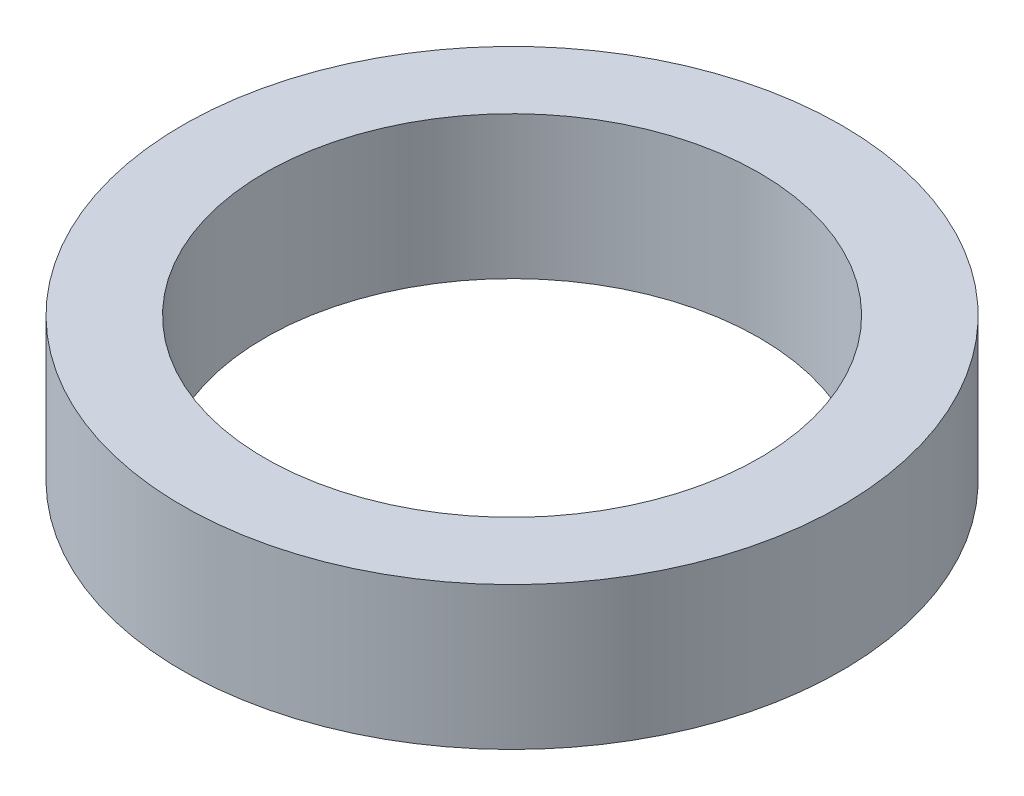
ISO-10303-21;
HEADER;
FILE_DESCRIPTION(('STEP AP214'),'2;1');
FILE_NAME('part.step','',(''),(''),'','','');
FILE_SCHEMA(('AUTOMOTIVE_DESIGN { 1 0 10303 214 1 1 1 1 }'));
ENDSEC;
DATA;
#1=APPLICATION_CONTEXT('core data for automotive mechanical design processes');
#2=APPLICATION_PROTOCOL_DEFINITION('international standard','automotive_design',2000,#1);
#3=PRODUCT_CONTEXT('',#1,'mechanical');
#4=PRODUCT('Part','Part','',(#3));
#5=PRODUCT_RELATED_PRODUCT_CATEGORY('part','',(#4));
#6=PRODUCT_DEFINITION_FORMATION('','',#4);
#7=PRODUCT_DEFINITION_CONTEXT('part definition',#1,'design');
#8=PRODUCT_DEFINITION('design','',#6,#7);
#9=PRODUCT_DEFINITION_SHAPE('','',#8);
#10=(LENGTH_UNIT() NAMED_UNIT(*) SI_UNIT(.MILLI.,.METRE.));
#11=(NAMED_UNIT(*) PLANE_ANGLE_UNIT() SI_UNIT($,.RADIAN.));
#12=(NAMED_UNIT(*) SI_UNIT($,.STERADIAN.) SOLID_ANGLE_UNIT());
#13=UNCERTAINTY_MEASURE_WITH_UNIT(LENGTH_MEASURE(1.E-05),#10,'distance_accuracy_value','');
#14=(GEOMETRIC_REPRESENTATION_CONTEXT(3) GLOBAL_UNCERTAINTY_ASSIGNED_CONTEXT((#13)) GLOBAL_UNIT_ASSIGNED_CONTEXT((#10,
#11,#12)) REPRESENTATION_CONTEXT('',''));
#15=CARTESIAN_POINT('',(0.,0.,0.));
#16=DIRECTION('',(0.,0.,1.));
#17=DIRECTION('',(1.,0.,0.));
#18=AXIS2_PLACEMENT_3D('',#15,#16,#17);
#19=CARTESIAN_POINT('',(0.,13.,0.));
#20=DIRECTION('',(0.,-1.,0.));
#21=DIRECTION('',(0.,0.,-1.));
#22=AXIS2_PLACEMENT_3D('',#19,#20,#21);
#23=CYLINDRICAL_SURFACE('',#22,30.);
#24=CARTESIAN_POINT('',(0.,13.,0.));
#25=DIRECTION('',(0.,1.,0.));
#26=DIRECTION('',(0.,0.,1.));
#27=AXIS2_PLACEMENT_3D('',#24,#25,#26);
#28=CIRCLE('',#27,30.);
#29=CARTESIAN_POINT('',(0.,13.,-30.));
#30=VERTEX_POINT('',#29);
#31=EDGE_CURVE('E10',#30,#30,#28,.T.);
#32=CARTESIAN_POINT('',(0.,0.,0.));
#33=DIRECTION('',(0.,1.,0.));
#34=DIRECTION('',(0.,0.,1.));
#35=AXIS2_PLACEMENT_3D('',#32,#33,#34);
#36=CIRCLE('',#35,30.);
#37=CARTESIAN_POINT('',(0.,0.,-30.));
#38=VERTEX_POINT('',#37);
#39=EDGE_CURVE('E37',#38,#38,#36,.T.);
#40=CARTESIAN_POINT('',(0.,13.,-30.));
#41=CARTESIAN_POINT('',(0.,12.8645833333333,-30.));
#42=CARTESIAN_POINT('',(0.,12.7291666666667,-30.));
#43=CARTESIAN_POINT('',(0.,12.4583333333333,-30.));
#44=CARTESIAN_POINT('',(0.,12.3229166666667,-30.));
#45=CARTESIAN_POINT('',(0.,12.0520833333333,-30.));
#46=CARTESIAN_POINT('',(0.,11.9166666666667,-30.));
#47=CARTESIAN_POINT('',(0.,11.6458333333333,-30.));
#48=CARTESIAN_POINT('',(0.,11.5104166666667,-30.));
#49=CARTESIAN_POINT('',(0.,11.2395833333333,-30.));
#50=CARTESIAN_POINT('',(0.,11.1041666666667,-30.));
#51=CARTESIAN_POINT('',(0.,10.8333333333333,-30.));
#52=CARTESIAN_POINT('',(0.,10.6979166666667,-30.));
#53=CARTESIAN_POINT('',(0.,10.4270833333333,-30.));
#54=CARTESIAN_POINT('',(0.,10.2916666666667,-30.));
#55=CARTESIAN_POINT('',(0.,10.0208333333333,-30.));
#56=CARTESIAN_POINT('',(0.,9.88541666666667,-30.));
#57=CARTESIAN_POINT('',(0.,9.61458333333333,-30.));
#58=CARTESIAN_POINT('',(0.,9.47916666666667,-30.));
#59=CARTESIAN_POINT('',(0.,9.20833333333333,-30.));
#60=CARTESIAN_POINT('',(0.,9.07291666666667,-30.));
#61=CARTESIAN_POINT('',(0.,8.80208333333333,-30.));
#62=CARTESIAN_POINT('',(0.,8.66666666666667,-30.));
#63=CARTESIAN_POINT('',(0.,8.39583333333333,-30.));
#64=CARTESIAN_POINT('',(0.,8.26041666666667,-30.));
#65=CARTESIAN_POINT('',(0.,7.98958333333333,-30.));
#66=CARTESIAN_POINT('',(0.,7.85416666666667,-30.));
#67=CARTESIAN_POINT('',(0.,7.58333333333333,-30.));
#68=CARTESIAN_POINT('',(0.,7.44791666666667,-30.));
#69=CARTESIAN_POINT('',(0.,7.17708333333333,-30.));
#70=CARTESIAN_POINT('',(0.,7.04166666666667,-30.));
#71=CARTESIAN_POINT('',(0.,6.77083333333333,-30.));
#72=CARTESIAN_POINT('',(0.,6.63541666666667,-30.));
#73=CARTESIAN_POINT('',(0.,6.36458333333333,-30.));
#74=CARTESIAN_POINT('',(0.,6.22916666666667,-30.));
#75=CARTESIAN_POINT('',(0.,5.95833333333333,-30.));
#76=CARTESIAN_POINT('',(0.,5.82291666666667,-30.));
#77=CARTESIAN_POINT('',(0.,5.55208333333333,-30.));
#78=CARTESIAN_POINT('',(0.,5.41666666666667,-30.));
#79=CARTESIAN_POINT('',(0.,5.14583333333333,-30.));
#80=CARTESIAN_POINT('',(0.,5.01041666666667,-30.));
#81=CARTESIAN_POINT('',(0.,4.73958333333333,-30.));
#82=CARTESIAN_POINT('',(0.,4.60416666666667,-30.));
#83=CARTESIAN_POINT('',(0.,4.33333333333333,-30.));
#84=CARTESIAN_POINT('',(0.,4.19791666666667,-30.));
#85=CARTESIAN_POINT('',(0.,3.92708333333333,-30.));
#86=CARTESIAN_POINT('',(0.,3.79166666666667,-30.));
#87=CARTESIAN_POINT('',(0.,3.52083333333333,-30.));
#88=CARTESIAN_POINT('',(0.,3.38541666666667,-30.));
#89=CARTESIAN_POINT('',(0.,3.11458333333333,-30.));
#90=CARTESIAN_POINT('',(0.,2.97916666666667,-30.));
#91=CARTESIAN_POINT('',(0.,2.70833333333333,-30.));
#92=CARTESIAN_POINT('',(0.,2.57291666666667,-30.));
#93=CARTESIAN_POINT('',(0.,2.30208333333333,-30.));
#94=CARTESIAN_POINT('',(0.,2.16666666666667,-30.));
#95=CARTESIAN_POINT('',(0.,1.89583333333333,-30.));
#96=CARTESIAN_POINT('',(0.,1.76041666666667,-30.));
#97=CARTESIAN_POINT('',(0.,1.48958333333333,-30.));
#98=CARTESIAN_POINT('',(0.,1.35416666666667,-30.));
#99=CARTESIAN_POINT('',(0.,1.08333333333333,-30.));
#100=CARTESIAN_POINT('',(0.,0.947916666666667,-30.));
#101=CARTESIAN_POINT('',(0.,0.677083333333334,-30.));
#102=CARTESIAN_POINT('',(0.,0.541666666666667,-30.));
#103=CARTESIAN_POINT('',(0.,0.270833333333334,-30.));
#104=CARTESIAN_POINT('',(0.,0.135416666666667,-30.));
#105=CARTESIAN_POINT('',(0.,0.,-30.));
#106=B_SPLINE_CURVE_WITH_KNOTS('',3,(#40,#41,#42,#43,#44,#45,#46,#47,#48,#49,#50,#51,#52,#53,
#54,#55,#56,#57,#58,#59,#60,#61,#62,#63,#64,#65,#66,#67,#68,#69,#70,#71,#72,#73,#74,#75,#76,#77,
#78,#79,#80,#81,#82,#83,#84,#85,#86,#87,#88,#89,#90,#91,#92,#93,#94,#95,#96,#97,#98,#99,#100,
#101,#102,#103,#104,#105),.UNSPECIFIED.,.F.,.F.,(4,2,2,2,2,2,2,2,2,2,2,2,2,2,2,2,2,2,2,2,2,2,2,
2,2,2,2,2,2,2,2,2,4),(0.,0.406249999999999,0.812499999999999,1.21875,1.625,2.03125,2.4375,
2.84375,3.25,3.65625,4.0625,4.46875,4.875,5.28125,5.6875,6.09375,6.5,6.90625,7.3125,7.71875,
8.125,8.53125,8.9375,9.34375,9.75,10.15625,10.5625,10.96875,11.375,11.78125,12.1875,12.59375,
13.),.UNSPECIFIED.);
#107=EDGE_CURVE('BSEAM40',#30,#38,#106,.T.);
#108=ORIENTED_EDGE('',*,*,#31,.F.);
#109=ORIENTED_EDGE('',*,*,#39,.T.);
#110=ORIENTED_EDGE('',*,*,#107,.T.);
#111=ORIENTED_EDGE('',*,*,#107,.F.);
#112=EDGE_LOOP('',(#108,#110,#109,#111));
#113=FACE_BOUND('',#112,.T.);
#114=ADVANCED_FACE('F40',(#113),#23,.T.);
#115=CARTESIAN_POINT('',(0.,13.,0.));
#116=DIRECTION('',(0.,1.,0.));
#117=DIRECTION('',(0.,0.,1.));
#118=AXIS2_PLACEMENT_3D('',#115,#116,#117);
#119=PLANE('',#118);
#120=CARTESIAN_POINT('',(0.,13.,0.));
#121=DIRECTION('',(0.,1.,0.));
#122=DIRECTION('',(0.,0.,1.));
#123=AXIS2_PLACEMENT_3D('',#120,#121,#122);
#124=CIRCLE('',#123,22.5);
#125=CARTESIAN_POINT('',(0.,13.,-22.5));
#126=VERTEX_POINT('',#125);
#127=EDGE_CURVE('E50',#126,#126,#124,.T.);
#128=ORIENTED_EDGE('',*,*,#127,.F.);
#129=EDGE_LOOP('',(#128));
#130=FACE_BOUND('',#129,.T.);
#131=ORIENTED_EDGE('',*,*,#31,.T.);
#132=EDGE_LOOP('',(#131));
#133=FACE_BOUND('',#132,.T.);
#134=ADVANCED_FACE('F59',(#130,#133),#119,.T.);
#135=CARTESIAN_POINT('',(0.,0.,0.));
#136=DIRECTION('',(0.,1.,0.));
#137=DIRECTION('',(0.,0.,1.));
#138=AXIS2_PLACEMENT_3D('',#135,#136,#137);
#139=PLANE('',#138);
#140=CARTESIAN_POINT('',(0.,0.,0.));
#141=DIRECTION('',(0.,1.,0.));
#142=DIRECTION('',(0.,0.,1.));
#143=AXIS2_PLACEMENT_3D('',#140,#141,#142);
#144=CIRCLE('',#143,22.5);
#145=CARTESIAN_POINT('',(0.,0.,-22.5));
#146=VERTEX_POINT('',#145);
#147=EDGE_CURVE('E47',#146,#146,#144,.T.);
#148=ORIENTED_EDGE('',*,*,#147,.T.);
#149=EDGE_LOOP('',(#148));
#150=FACE_BOUND('',#149,.T.);
#151=ORIENTED_EDGE('',*,*,#39,.F.);
#152=EDGE_LOOP('',(#151));
#153=FACE_BOUND('',#152,.T.);
#154=ADVANCED_FACE('F58',(#150,#153),#139,.F.);
#155=CARTESIAN_POINT('',(0.,13.,0.));
#156=DIRECTION('',(0.,-1.,0.));
#157=DIRECTION('',(0.,0.,-1.));
#158=AXIS2_PLACEMENT_3D('',#155,#156,#157);
#159=CYLINDRICAL_SURFACE('',#158,22.5);
#160=CARTESIAN_POINT('',(0.,13.,-22.5));
#161=CARTESIAN_POINT('',(0.,12.8645833333333,-22.5));
#162=CARTESIAN_POINT('',(0.,12.7291666666667,-22.5));
#163=CARTESIAN_POINT('',(0.,12.4583333333333,-22.5));
#164=CARTESIAN_POINT('',(0.,12.3229166666667,-22.5));
#165=CARTESIAN_POINT('',(0.,12.0520833333333,-22.5));
#166=CARTESIAN_POINT('',(0.,11.9166666666667,-22.5));
#167=CARTESIAN_POINT('',(0.,11.6458333333333,-22.5));
#168=CARTESIAN_POINT('',(0.,11.5104166666667,-22.5));
#169=CARTESIAN_POINT('',(0.,11.2395833333333,-22.5));
#170=CARTESIAN_POINT('',(0.,11.1041666666667,-22.5));
#171=CARTESIAN_POINT('',(0.,10.8333333333333,-22.5));
#172=CARTESIAN_POINT('',(0.,10.6979166666667,-22.5));
#173=CARTESIAN_POINT('',(0.,10.4270833333333,-22.5));
#174=CARTESIAN_POINT('',(0.,10.2916666666667,-22.5));
#175=CARTESIAN_POINT('',(0.,10.0208333333333,-22.5));
#176=CARTESIAN_POINT('',(0.,9.88541666666667,-22.5));
#177=CARTESIAN_POINT('',(0.,9.61458333333333,-22.5));
#178=CARTESIAN_POINT('',(0.,9.47916666666667,-22.5));
#179=CARTESIAN_POINT('',(0.,9.20833333333333,-22.5));
#180=CARTESIAN_POINT('',(0.,9.07291666666667,-22.5));
#181=CARTESIAN_POINT('',(0.,8.80208333333333,-22.5));
#182=CARTESIAN_POINT('',(0.,8.66666666666667,-22.5));
#183=CARTESIAN_POINT('',(0.,8.39583333333333,-22.5));
#184=CARTESIAN_POINT('',(0.,8.26041666666667,-22.5));
#185=CARTESIAN_POINT('',(0.,7.98958333333333,-22.5));
#186=CARTESIAN_POINT('',(0.,7.85416666666667,-22.5));
#187=CARTESIAN_POINT('',(0.,7.58333333333333,-22.5));
#188=CARTESIAN_POINT('',(0.,7.44791666666667,-22.5));
#189=CARTESIAN_POINT('',(0.,7.17708333333333,-22.5));
#190=CARTESIAN_POINT('',(0.,7.04166666666667,-22.5));
#191=CARTESIAN_POINT('',(0.,6.77083333333333,-22.5));
#192=CARTESIAN_POINT('',(0.,6.63541666666667,-22.5));
#193=CARTESIAN_POINT('',(0.,6.36458333333333,-22.5));
#194=CARTESIAN_POINT('',(0.,6.22916666666667,-22.5));
#195=CARTESIAN_POINT('',(0.,5.95833333333333,-22.5));
#196=CARTESIAN_POINT('',(0.,5.82291666666667,-22.5));
#197=CARTESIAN_POINT('',(0.,5.55208333333333,-22.5));
#198=CARTESIAN_POINT('',(0.,5.41666666666667,-22.5));
#199=CARTESIAN_POINT('',(0.,5.14583333333333,-22.5));
#200=CARTESIAN_POINT('',(0.,5.01041666666667,-22.5));
#201=CARTESIAN_POINT('',(0.,4.73958333333333,-22.5));
#202=CARTESIAN_POINT('',(0.,4.60416666666667,-22.5));
#203=CARTESIAN_POINT('',(0.,4.33333333333333,-22.5));
#204=CARTESIAN_POINT('',(0.,4.19791666666667,-22.5));
#205=CARTESIAN_POINT('',(0.,3.92708333333333,-22.5));
#206=CARTESIAN_POINT('',(0.,3.79166666666667,-22.5));
#207=CARTESIAN_POINT('',(0.,3.52083333333333,-22.5));
#208=CARTESIAN_POINT('',(0.,3.38541666666667,-22.5));
#209=CARTESIAN_POINT('',(0.,3.11458333333333,-22.5));
#210=CARTESIAN_POINT('',(0.,2.97916666666667,-22.5));
#211=CARTESIAN_POINT('',(0.,2.70833333333333,-22.5));
#212=CARTESIAN_POINT('',(0.,2.57291666666667,-22.5));
#213=CARTESIAN_POINT('',(0.,2.30208333333333,-22.5));
#214=CARTESIAN_POINT('',(0.,2.16666666666667,-22.5));
#215=CARTESIAN_POINT('',(0.,1.89583333333333,-22.5));
#216=CARTESIAN_POINT('',(0.,1.76041666666667,-22.5));
#217=CARTESIAN_POINT('',(0.,1.48958333333333,-22.5));
#218=CARTESIAN_POINT('',(0.,1.35416666666667,-22.5));
#219=CARTESIAN_POINT('',(0.,1.08333333333333,-22.5));
#220=CARTESIAN_POINT('',(0.,0.947916666666667,-22.5));
#221=CARTESIAN_POINT('',(0.,0.677083333333334,-22.5));
#222=CARTESIAN_POINT('',(0.,0.541666666666667,-22.5));
#223=CARTESIAN_POINT('',(0.,0.270833333333334,-22.5));
#224=CARTESIAN_POINT('',(0.,0.135416666666667,-22.5));
#225=CARTESIAN_POINT('',(0.,0.,-22.5));
#226=B_SPLINE_CURVE_WITH_KNOTS('',3,(#160,#161,#162,#163,#164,#165,#166,#167,#168,#169,#170,
#171,#172,#173,#174,#175,#176,#177,#178,#179,#180,#181,#182,#183,#184,#185,#186,#187,#188,#189,
#190,#191,#192,#193,#194,#195,#196,#197,#198,#199,#200,#201,#202,#203,#204,#205,#206,#207,#208,
#209,#210,#211,#212,#213,#214,#215,#216,#217,#218,#219,#220,#221,#222,#223,#224,#225),
.UNSPECIFIED.,.F.,.F.,(4,2,2,2,2,2,2,2,2,2,2,2,2,2,2,2,2,2,2,2,2,2,2,2,2,2,2,2,2,2,2,2,4),(0.,
0.406249999999999,0.812499999999999,1.21875,1.625,2.03125,2.4375,2.84375,3.25,3.65625,4.0625,
4.46875,4.875,5.28125,5.6875,6.09375,6.5,6.90625,7.3125,7.71875,8.125,8.53125,8.9375,9.34375,
9.75,10.15625,10.5625,10.96875,11.375,11.78125,12.1875,12.59375,13.),.UNSPECIFIED.);
#227=EDGE_CURVE('BSEAM54',#126,#146,#226,.T.);
#228=ORIENTED_EDGE('',*,*,#127,.T.);
#229=ORIENTED_EDGE('',*,*,#147,.F.);
#230=ORIENTED_EDGE('',*,*,#227,.T.);
#231=ORIENTED_EDGE('',*,*,#227,.F.);
#232=EDGE_LOOP('',(#228,#230,#229,#231));
#233=FACE_BOUND('',#232,.T.);
#234=ADVANCED_FACE('F54',(#233),#159,.F.);
#235=CLOSED_SHELL('',(#114,#134,#154,#234));
#236=MANIFOLD_SOLID_BREP('B2',#235);
#237=ADVANCED_BREP_SHAPE_REPRESENTATION('',(#18,#236),#14);
#238=SHAPE_DEFINITION_REPRESENTATION(#9,#237);
ENDSEC;
END-ISO-10303-21;
